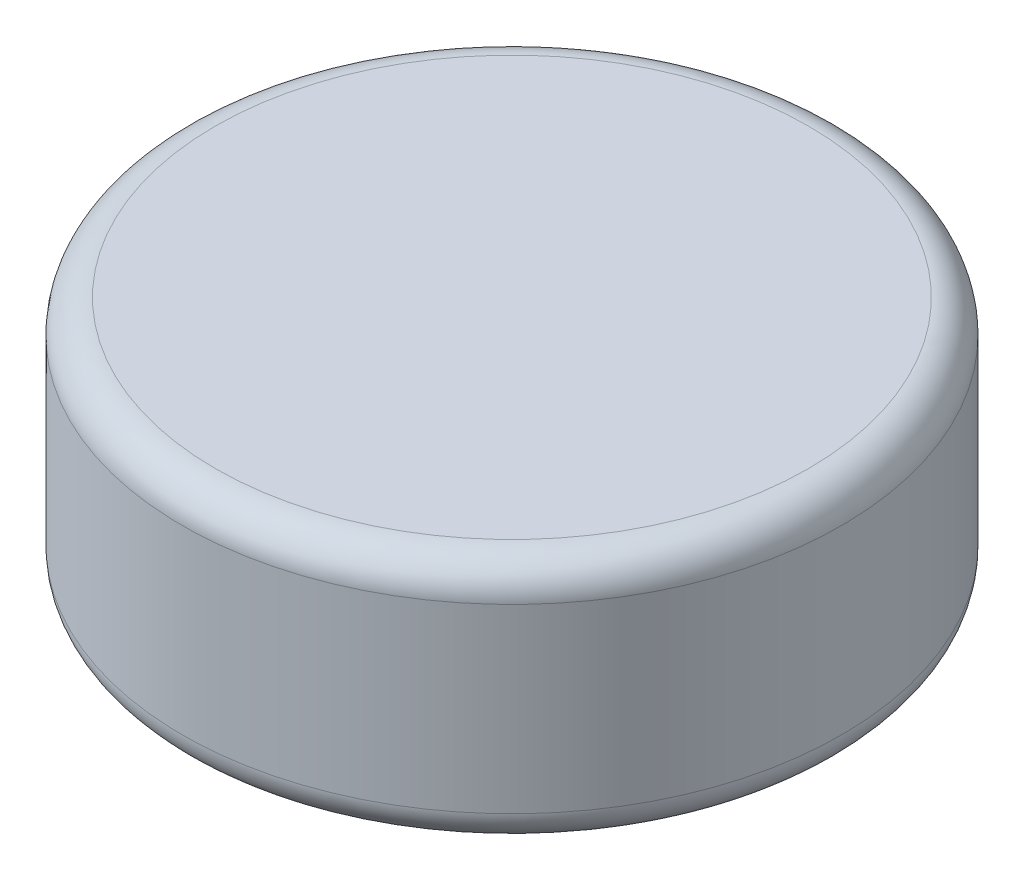
ISO-10303-21;
HEADER;
FILE_DESCRIPTION(('STEP AP214'),'2;1');
FILE_NAME('part.step','',(''),(''),'','','');
FILE_SCHEMA(('AUTOMOTIVE_DESIGN { 1 0 10303 214 1 1 1 1 }'));
ENDSEC;
DATA;
#1=APPLICATION_CONTEXT('core data for automotive mechanical design processes');
#2=APPLICATION_PROTOCOL_DEFINITION('international standard','automotive_design',2000,#1);
#3=PRODUCT_CONTEXT('',#1,'mechanical');
#4=PRODUCT('Part','Part','',(#3));
#5=PRODUCT_RELATED_PRODUCT_CATEGORY('part','',(#4));
#6=PRODUCT_DEFINITION_FORMATION('','',#4);
#7=PRODUCT_DEFINITION_CONTEXT('part definition',#1,'design');
#8=PRODUCT_DEFINITION('design','',#6,#7);
#9=PRODUCT_DEFINITION_SHAPE('','',#8);
#10=(LENGTH_UNIT() NAMED_UNIT(*) SI_UNIT(.MILLI.,.METRE.));
#11=(NAMED_UNIT(*) PLANE_ANGLE_UNIT() SI_UNIT($,.RADIAN.));
#12=(NAMED_UNIT(*) SI_UNIT($,.STERADIAN.) SOLID_ANGLE_UNIT());
#13=UNCERTAINTY_MEASURE_WITH_UNIT(LENGTH_MEASURE(1.E-05),#10,'distance_accuracy_value','');
#14=(GEOMETRIC_REPRESENTATION_CONTEXT(3) GLOBAL_UNCERTAINTY_ASSIGNED_CONTEXT((#13)) GLOBAL_UNIT_ASSIGNED_CONTEXT((#10,
#11,#12)) REPRESENTATION_CONTEXT('',''));
#15=CARTESIAN_POINT('',(0.,0.,0.));
#16=DIRECTION('',(0.,0.,1.));
#17=DIRECTION('',(1.,0.,0.));
#18=AXIS2_PLACEMENT_3D('',#15,#16,#17);
#19=CARTESIAN_POINT('',(0.,1.5,0.));
#20=DIRECTION('',(0.,-1.,0.));
#21=DIRECTION('',(0.,0.,1.));
#22=AXIS2_PLACEMENT_3D('',#19,#20,#21);
#23=CYLINDRICAL_SURFACE('',#22,2.);
#24=CARTESIAN_POINT('',(0.,0.2,0.));
#25=DIRECTION('',(0.,-1.,0.));
#26=DIRECTION('',(0.,0.,-1.));
#27=AXIS2_PLACEMENT_3D('',#24,#25,#26);
#28=CIRCLE('',#27,2.);
#29=CARTESIAN_POINT('',(0.,0.2,-2.));
#30=VERTEX_POINT('',#29);
#31=EDGE_CURVE('E46',#30,#30,#28,.T.);
#32=ORIENTED_EDGE('',*,*,#31,.F.);
#33=EDGE_LOOP('',(#32));
#34=FACE_BOUND('',#33,.T.);
#35=CARTESIAN_POINT('',(0.,1.3,0.));
#36=DIRECTION('',(0.,-1.,0.));
#37=DIRECTION('',(0.,0.,-1.));
#38=AXIS2_PLACEMENT_3D('',#35,#36,#37);
#39=CIRCLE('',#38,2.);
#40=CARTESIAN_POINT('',(0.,1.3,-2.));
#41=VERTEX_POINT('',#40);
#42=EDGE_CURVE('E50',#41,#41,#39,.F.);
#43=ORIENTED_EDGE('',*,*,#42,.F.);
#44=EDGE_LOOP('',(#43));
#45=FACE_BOUND('',#44,.T.);
#46=ADVANCED_FACE('F35',(#34,#45),#23,.T.);
#47=CARTESIAN_POINT('',(0.,1.5,0.));
#48=DIRECTION('',(0.,1.,0.));
#49=DIRECTION('',(0.,0.,-1.));
#50=AXIS2_PLACEMENT_3D('',#47,#48,#49);
#51=PLANE('',#50);
#52=CARTESIAN_POINT('',(0.,1.5,0.));
#53=DIRECTION('',(0.,-1.,0.));
#54=DIRECTION('',(0.,0.,-1.));
#55=AXIS2_PLACEMENT_3D('',#52,#53,#54);
#56=CIRCLE('',#55,1.8);
#57=CARTESIAN_POINT('',(0.,1.5,-1.8));
#58=VERTEX_POINT('',#57);
#59=EDGE_CURVE('E10',#58,#58,#56,.T.);
#60=ORIENTED_EDGE('',*,*,#59,.F.);
#61=EDGE_LOOP('',(#60));
#62=FACE_BOUND('',#61,.T.);
#63=ADVANCED_FACE('F58',(#62),#51,.T.);
#64=CARTESIAN_POINT('',(0.,0.,0.));
#65=DIRECTION('',(0.,1.,0.));
#66=DIRECTION('',(0.,0.,-1.));
#67=AXIS2_PLACEMENT_3D('',#64,#65,#66);
#68=PLANE('',#67);
#69=CARTESIAN_POINT('',(0.,0.,0.));
#70=DIRECTION('',(0.,-1.,0.));
#71=DIRECTION('',(0.,0.,-1.));
#72=AXIS2_PLACEMENT_3D('',#69,#70,#71);
#73=CIRCLE('',#72,1.8);
#74=CARTESIAN_POINT('',(0.,0.,-1.8));
#75=VERTEX_POINT('',#74);
#76=EDGE_CURVE('E42',#75,#75,#73,.F.);
#77=ORIENTED_EDGE('',*,*,#76,.F.);
#78=EDGE_LOOP('',(#77));
#79=FACE_BOUND('',#78,.T.);
#80=ADVANCED_FACE('F64',(#79),#68,.F.);
#81=CARTESIAN_POINT('',(0.,0.2,0.));
#82=DIRECTION('',(0.,1.,0.));
#83=DIRECTION('',(0.,0.,-1.));
#84=AXIS2_PLACEMENT_3D('',#81,#82,#83);
#85=TOROIDAL_SURFACE('',#84,1.8,0.2);
#86=ORIENTED_EDGE('',*,*,#76,.T.);
#87=EDGE_LOOP('',(#86));
#88=FACE_BOUND('',#87,.T.);
#89=ORIENTED_EDGE('',*,*,#31,.T.);
#90=EDGE_LOOP('',(#89));
#91=FACE_BOUND('',#90,.T.);
#92=ADVANCED_FACE('F69',(#88,#91),#85,.T.);
#93=CARTESIAN_POINT('',(0.,1.3,0.));
#94=DIRECTION('',(0.,1.,0.));
#95=DIRECTION('',(0.,0.,-1.));
#96=AXIS2_PLACEMENT_3D('',#93,#94,#95);
#97=TOROIDAL_SURFACE('',#96,1.8,0.2);
#98=ORIENTED_EDGE('',*,*,#42,.T.);
#99=EDGE_LOOP('',(#98));
#100=FACE_BOUND('',#99,.T.);
#101=ORIENTED_EDGE('',*,*,#59,.T.);
#102=EDGE_LOOP('',(#101));
#103=FACE_BOUND('',#102,.T.);
#104=ADVANCED_FACE('F37',(#100,#103),#97,.T.);
#105=CLOSED_SHELL('',(#46,#63,#80,#92,#104));
#106=MANIFOLD_SOLID_BREP('B2',#105);
#107=ADVANCED_BREP_SHAPE_REPRESENTATION('',(#18,#106),#14);
#108=SHAPE_DEFINITION_REPRESENTATION(#9,#107);
ENDSEC;
END-ISO-10303-21;
